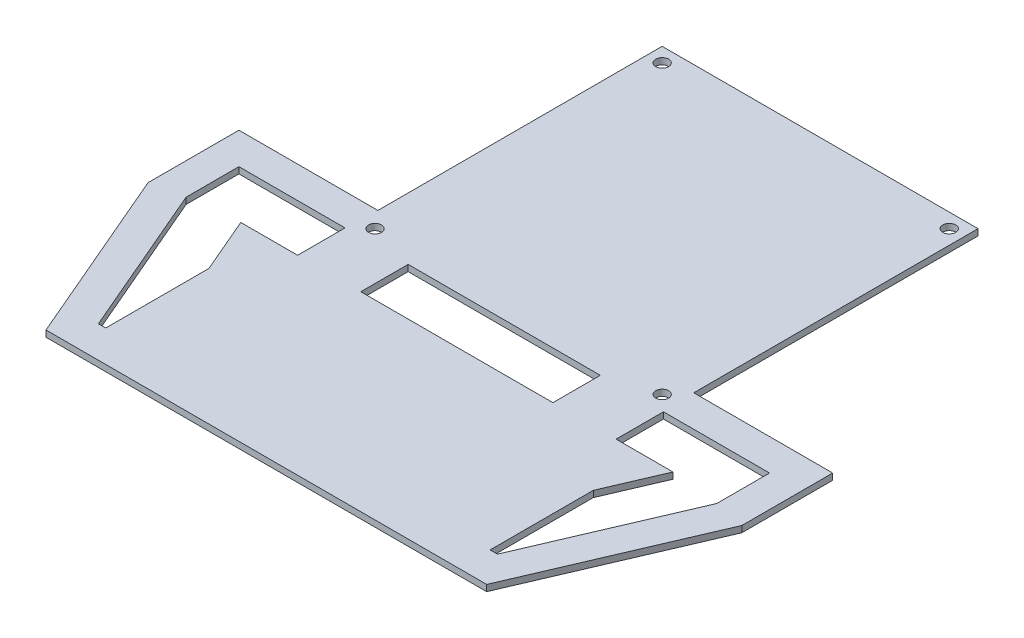
ISO-10303-21;
HEADER;
FILE_DESCRIPTION(('STEP AP214'),'2;1');
FILE_NAME('part.step','',(''),(''),'','','');
FILE_SCHEMA(('AUTOMOTIVE_DESIGN { 1 0 10303 214 1 1 1 1 }'));
ENDSEC;
DATA;
#1=APPLICATION_CONTEXT('core data for automotive mechanical design processes');
#2=APPLICATION_PROTOCOL_DEFINITION('international standard','automotive_design',2000,#1);
#3=PRODUCT_CONTEXT('',#1,'mechanical');
#4=PRODUCT('Part','Part','',(#3));
#5=PRODUCT_RELATED_PRODUCT_CATEGORY('part','',(#4));
#6=PRODUCT_DEFINITION_FORMATION('','',#4);
#7=PRODUCT_DEFINITION_CONTEXT('part definition',#1,'design');
#8=PRODUCT_DEFINITION('design','',#6,#7);
#9=PRODUCT_DEFINITION_SHAPE('','',#8);
#10=(LENGTH_UNIT() NAMED_UNIT(*) SI_UNIT(.MILLI.,.METRE.));
#11=(NAMED_UNIT(*) PLANE_ANGLE_UNIT() SI_UNIT($,.RADIAN.));
#12=(NAMED_UNIT(*) SI_UNIT($,.STERADIAN.) SOLID_ANGLE_UNIT());
#13=UNCERTAINTY_MEASURE_WITH_UNIT(LENGTH_MEASURE(1.E-05),#10,'distance_accuracy_value','');
#14=(GEOMETRIC_REPRESENTATION_CONTEXT(3) GLOBAL_UNCERTAINTY_ASSIGNED_CONTEXT((#13)) GLOBAL_UNIT_ASSIGNED_CONTEXT((#10,
#11,#12)) REPRESENTATION_CONTEXT('',''));
#15=CARTESIAN_POINT('',(0.,0.,0.));
#16=DIRECTION('',(0.,0.,1.));
#17=DIRECTION('',(1.,0.,0.));
#18=AXIS2_PLACEMENT_3D('',#15,#16,#17);
#19=CARTESIAN_POINT('',(0.,2.,40.0000000000001));
#20=DIRECTION('',(0.,0.,-1.));
#21=DIRECTION('',(-1.,0.,0.));
#22=AXIS2_PLACEMENT_3D('',#19,#20,#21);
#23=PLANE('',#22);
#24=DIRECTION('',(1.,0.,0.));
#25=VECTOR('',#24,1.);
#26=CARTESIAN_POINT('',(0.,0.,40.0000000000001));
#27=LINE('',#26,#25);
#28=CARTESIAN_POINT('',(50.,0.,40.0000000000001));
#29=VERTEX_POINT('',#28);
#30=CARTESIAN_POINT('',(94.,0.,40.0000000000001));
#31=VERTEX_POINT('',#30);
#32=EDGE_CURVE('E328',#29,#31,#27,.T.);
#33=ORIENTED_EDGE('',*,*,#32,.F.);
#34=DIRECTION('',(0.,-1.,0.));
#35=VECTOR('',#34,1.);
#36=CARTESIAN_POINT('',(50.,2.,40.0000000000001));
#37=LINE('',#36,#35);
#38=CARTESIAN_POINT('',(50.,2.,40.0000000000001));
#39=VERTEX_POINT('',#38);
#40=EDGE_CURVE('E403',#39,#29,#37,.T.);
#41=ORIENTED_EDGE('',*,*,#40,.F.);
#42=DIRECTION('',(1.,0.,0.));
#43=VECTOR('',#42,1.);
#44=CARTESIAN_POINT('',(0.,2.,40.0000000000001));
#45=LINE('',#44,#43);
#46=CARTESIAN_POINT('',(94.,2.,40.0000000000001));
#47=VERTEX_POINT('',#46);
#48=EDGE_CURVE('E331',#39,#47,#45,.T.);
#49=ORIENTED_EDGE('',*,*,#48,.T.);
#50=DIRECTION('',(0.,-1.,0.));
#51=VECTOR('',#50,1.);
#52=CARTESIAN_POINT('',(94.,2.,40.0000000000001));
#53=LINE('',#52,#51);
#54=EDGE_CURVE('E357',#47,#31,#53,.T.);
#55=ORIENTED_EDGE('',*,*,#54,.T.);
#56=EDGE_LOOP('',(#33,#41,#49,#55));
#57=FACE_BOUND('',#56,.T.);
#58=ADVANCED_FACE('F34',(#57),#23,.T.);
#59=CARTESIAN_POINT('',(50.,2.,0.));
#60=DIRECTION('',(-1.,0.,0.));
#61=DIRECTION('',(0.,0.,1.));
#62=AXIS2_PLACEMENT_3D('',#59,#60,#61);
#63=PLANE('',#62);
#64=DIRECTION('',(0.,0.,-1.));
#65=VECTOR('',#64,1.);
#66=CARTESIAN_POINT('',(50.,0.,0.));
#67=LINE('',#66,#65);
#68=CARTESIAN_POINT('',(50.,0.,-50.));
#69=VERTEX_POINT('',#68);
#70=EDGE_CURVE('E360',#29,#69,#67,.T.);
#71=ORIENTED_EDGE('',*,*,#70,.T.);
#72=DIRECTION('',(0.,-1.,0.));
#73=VECTOR('',#72,1.);
#74=CARTESIAN_POINT('',(50.,2.,-50.));
#75=LINE('',#74,#73);
#76=CARTESIAN_POINT('',(50.,2.,-50.));
#77=VERTEX_POINT('',#76);
#78=EDGE_CURVE('E400',#77,#69,#75,.T.);
#79=ORIENTED_EDGE('',*,*,#78,.F.);
#80=DIRECTION('',(0.,0.,-1.));
#81=VECTOR('',#80,1.);
#82=CARTESIAN_POINT('',(50.,2.,0.));
#83=LINE('',#82,#81);
#84=EDGE_CURVE('E334',#39,#77,#83,.T.);
#85=ORIENTED_EDGE('',*,*,#84,.F.);
#86=ORIENTED_EDGE('',*,*,#40,.T.);
#87=EDGE_LOOP('',(#71,#79,#85,#86));
#88=FACE_BOUND('',#87,.T.);
#89=ADVANCED_FACE('F529',(#88),#63,.F.);
#90=CARTESIAN_POINT('',(0.,2.,-50.));
#91=DIRECTION('',(0.,0.,1.));
#92=DIRECTION('',(1.,0.,0.));
#93=AXIS2_PLACEMENT_3D('',#90,#91,#92);
#94=PLANE('',#93);
#95=DIRECTION('',(-1.,0.,0.));
#96=VECTOR('',#95,1.);
#97=CARTESIAN_POINT('',(0.,0.,-50.));
#98=LINE('',#97,#96);
#99=CARTESIAN_POINT('',(-50.,0.,-50.));
#100=VERTEX_POINT('',#99);
#101=EDGE_CURVE('E362',#69,#100,#98,.T.);
#102=ORIENTED_EDGE('',*,*,#101,.T.);
#103=DIRECTION('',(0.,-1.,0.));
#104=VECTOR('',#103,1.);
#105=CARTESIAN_POINT('',(-50.,2.,-50.));
#106=LINE('',#105,#104);
#107=CARTESIAN_POINT('',(-50.,2.,-50.));
#108=VERTEX_POINT('',#107);
#109=EDGE_CURVE('E398',#108,#100,#106,.T.);
#110=ORIENTED_EDGE('',*,*,#109,.F.);
#111=DIRECTION('',(-1.,0.,0.));
#112=VECTOR('',#111,1.);
#113=CARTESIAN_POINT('',(0.,2.,-50.));
#114=LINE('',#113,#112);
#115=EDGE_CURVE('E337',#77,#108,#114,.T.);
#116=ORIENTED_EDGE('',*,*,#115,.F.);
#117=ORIENTED_EDGE('',*,*,#78,.T.);
#118=EDGE_LOOP('',(#102,#110,#116,#117));
#119=FACE_BOUND('',#118,.T.);
#120=ADVANCED_FACE('F534',(#119),#94,.F.);
#121=CARTESIAN_POINT('',(-50.,2.,0.));
#122=DIRECTION('',(-1.,0.,0.));
#123=DIRECTION('',(0.,0.,1.));
#124=AXIS2_PLACEMENT_3D('',#121,#122,#123);
#125=PLANE('',#124);
#126=DIRECTION('',(0.,0.,-1.));
#127=VECTOR('',#126,1.);
#128=CARTESIAN_POINT('',(-50.,0.,0.));
#129=LINE('',#128,#127);
#130=CARTESIAN_POINT('',(-50.,0.,40.0000000000001));
#131=VERTEX_POINT('',#130);
#132=EDGE_CURVE('E365',#131,#100,#129,.T.);
#133=ORIENTED_EDGE('',*,*,#132,.F.);
#134=DIRECTION('',(0.,-1.,0.));
#135=VECTOR('',#134,1.);
#136=CARTESIAN_POINT('',(-50.,2.,40.0000000000001));
#137=LINE('',#136,#135);
#138=CARTESIAN_POINT('',(-50.,2.,40.0000000000001));
#139=VERTEX_POINT('',#138);
#140=EDGE_CURVE('E396',#139,#131,#137,.T.);
#141=ORIENTED_EDGE('',*,*,#140,.F.);
#142=DIRECTION('',(0.,0.,-1.));
#143=VECTOR('',#142,1.);
#144=CARTESIAN_POINT('',(-50.,2.,0.));
#145=LINE('',#144,#143);
#146=EDGE_CURVE('E339',#139,#108,#145,.T.);
#147=ORIENTED_EDGE('',*,*,#146,.T.);
#148=ORIENTED_EDGE('',*,*,#109,.T.);
#149=EDGE_LOOP('',(#133,#141,#147,#148));
#150=FACE_BOUND('',#149,.T.);
#151=ADVANCED_FACE('F571',(#150),#125,.T.);
#152=CARTESIAN_POINT('',(0.,2.,40.0000000000001));
#153=DIRECTION('',(0.,0.,1.));
#154=DIRECTION('',(1.,0.,0.));
#155=AXIS2_PLACEMENT_3D('',#152,#153,#154);
#156=PLANE('',#155);
#157=DIRECTION('',(-1.,0.,0.));
#158=VECTOR('',#157,1.);
#159=CARTESIAN_POINT('',(0.,0.,40.0000000000001));
#160=LINE('',#159,#158);
#161=CARTESIAN_POINT('',(-94.,0.,40.0000000000001));
#162=VERTEX_POINT('',#161);
#163=EDGE_CURVE('E368',#131,#162,#160,.T.);
#164=ORIENTED_EDGE('',*,*,#163,.T.);
#165=DIRECTION('',(0.,-1.,0.));
#166=VECTOR('',#165,1.);
#167=CARTESIAN_POINT('',(-94.,2.,40.0000000000001));
#168=LINE('',#167,#166);
#169=CARTESIAN_POINT('',(-94.,2.,40.0000000000001));
#170=VERTEX_POINT('',#169);
#171=EDGE_CURVE('E393',#170,#162,#168,.T.);
#172=ORIENTED_EDGE('',*,*,#171,.F.);
#173=DIRECTION('',(-1.,0.,0.));
#174=VECTOR('',#173,1.);
#175=CARTESIAN_POINT('',(0.,2.,40.0000000000001));
#176=LINE('',#175,#174);
#177=EDGE_CURVE('E342',#139,#170,#176,.T.);
#178=ORIENTED_EDGE('',*,*,#177,.F.);
#179=ORIENTED_EDGE('',*,*,#140,.T.);
#180=EDGE_LOOP('',(#164,#172,#178,#179));
#181=FACE_BOUND('',#180,.T.);
#182=ADVANCED_FACE('F568',(#181),#156,.F.);
#183=CARTESIAN_POINT('',(-94.,2.,1.36035679588699E-13));
#184=DIRECTION('',(1.,0.,0.));
#185=DIRECTION('',(0.,0.,-1.));
#186=AXIS2_PLACEMENT_3D('',#183,#184,#185);
#187=PLANE('',#186);
#188=DIRECTION('',(0.,0.,1.));
#189=VECTOR('',#188,1.);
#190=CARTESIAN_POINT('',(-94.,0.,1.36035679588699E-13));
#191=LINE('',#190,#189);
#192=CARTESIAN_POINT('',(-93.9999999999999,0.,68.7684537882722));
#193=VERTEX_POINT('',#192);
#194=EDGE_CURVE('E370',#162,#193,#191,.T.);
#195=ORIENTED_EDGE('',*,*,#194,.T.);
#196=DIRECTION('',(0.,-1.,0.));
#197=VECTOR('',#196,1.);
#198=CARTESIAN_POINT('',(-93.9999999999999,2.,68.7684537882722));
#199=LINE('',#198,#197);
#200=CARTESIAN_POINT('',(-93.9999999999999,2.,68.7684537882722));
#201=VERTEX_POINT('',#200);
#202=EDGE_CURVE('E391',#201,#193,#199,.T.);
#203=ORIENTED_EDGE('',*,*,#202,.F.);
#204=DIRECTION('',(0.,0.,1.));
#205=VECTOR('',#204,1.);
#206=CARTESIAN_POINT('',(-94.,2.,1.36035679588699E-13));
#207=LINE('',#206,#205);
#208=EDGE_CURVE('E344',#170,#201,#207,.T.);
#209=ORIENTED_EDGE('',*,*,#208,.F.);
#210=ORIENTED_EDGE('',*,*,#171,.T.);
#211=EDGE_LOOP('',(#195,#203,#209,#210));
#212=FACE_BOUND('',#211,.T.);
#213=ADVANCED_FACE('F563',(#212),#187,.F.);
#214=CARTESIAN_POINT('',(-104.311598443848,2.,44.711653626802));
#215=DIRECTION('',(-0.919123708270864,0.,0.393969045604368));
#216=DIRECTION('',(0.393969045604367,0.,0.919123708270864));
#217=AXIS2_PLACEMENT_3D('',#214,#215,#216);
#218=PLANE('',#217);
#219=DIRECTION('',(-0.393969045604368,0.,-0.919123708270864));
#220=VECTOR('',#219,1.);
#221=CARTESIAN_POINT('',(-104.311598443848,0.,44.711653626802));
#222=LINE('',#221,#220);
#223=CARTESIAN_POINT('',(-69.76,0.,125.32));
#224=VERTEX_POINT('',#223);
#225=EDGE_CURVE('E373',#224,#193,#222,.T.);
#226=ORIENTED_EDGE('',*,*,#225,.F.);
#227=DIRECTION('',(0.,-1.,0.));
#228=VECTOR('',#227,1.);
#229=CARTESIAN_POINT('',(-69.76,2.,125.32));
#230=LINE('',#229,#228);
#231=CARTESIAN_POINT('',(-69.76,2.,125.32));
#232=VERTEX_POINT('',#231);
#233=EDGE_CURVE('E389',#232,#224,#230,.T.);
#234=ORIENTED_EDGE('',*,*,#233,.F.);
#235=DIRECTION('',(-0.393969045604368,0.,-0.919123708270864));
#236=VECTOR('',#235,1.);
#237=CARTESIAN_POINT('',(-104.311598443848,2.,44.711653626802));
#238=LINE('',#237,#236);
#239=EDGE_CURVE('E346',#232,#201,#238,.T.);
#240=ORIENTED_EDGE('',*,*,#239,.T.);
#241=ORIENTED_EDGE('',*,*,#202,.T.);
#242=EDGE_LOOP('',(#226,#234,#240,#241));
#243=FACE_BOUND('',#242,.T.);
#244=ADVANCED_FACE('F557',(#243),#218,.T.);
#245=CARTESIAN_POINT('',(0.,2.,125.32));
#246=DIRECTION('',(0.,0.,1.));
#247=DIRECTION('',(1.,0.,0.));
#248=AXIS2_PLACEMENT_3D('',#245,#246,#247);
#249=PLANE('',#248);
#250=DIRECTION('',(-1.,0.,0.));
#251=VECTOR('',#250,1.);
#252=CARTESIAN_POINT('',(0.,0.,125.32));
#253=LINE('',#252,#251);
#254=CARTESIAN_POINT('',(69.76,0.,125.32));
#255=VERTEX_POINT('',#254);
#256=EDGE_CURVE('E376',#255,#224,#253,.T.);
#257=ORIENTED_EDGE('',*,*,#256,.F.);
#258=DIRECTION('',(0.,-1.,0.));
#259=VECTOR('',#258,1.);
#260=CARTESIAN_POINT('',(69.76,2.,125.32));
#261=LINE('',#260,#259);
#262=CARTESIAN_POINT('',(69.76,2.,125.32));
#263=VERTEX_POINT('',#262);
#264=EDGE_CURVE('E387',#263,#255,#261,.T.);
#265=ORIENTED_EDGE('',*,*,#264,.F.);
#266=DIRECTION('',(-1.,0.,0.));
#267=VECTOR('',#266,1.);
#268=CARTESIAN_POINT('',(0.,2.,125.32));
#269=LINE('',#268,#267);
#270=EDGE_CURVE('E349',#263,#232,#269,.T.);
#271=ORIENTED_EDGE('',*,*,#270,.T.);
#272=ORIENTED_EDGE('',*,*,#233,.T.);
#273=EDGE_LOOP('',(#257,#265,#271,#272));
#274=FACE_BOUND('',#273,.T.);
#275=ADVANCED_FACE('F552',(#274),#249,.T.);
#276=CARTESIAN_POINT('',(104.311598443848,2.,44.7116536268021));
#277=DIRECTION('',(-0.919123708270864,0.,-0.393969045604368));
#278=DIRECTION('',(-0.393969045604368,0.,0.919123708270864));
#279=AXIS2_PLACEMENT_3D('',#276,#277,#278);
#280=PLANE('',#279);
#281=DIRECTION('',(0.393969045604368,0.,-0.919123708270864));
#282=VECTOR('',#281,1.);
#283=CARTESIAN_POINT('',(104.311598443848,0.,44.7116536268021));
#284=LINE('',#283,#282);
#285=CARTESIAN_POINT('',(94.,0.,68.7684537882722));
#286=VERTEX_POINT('',#285);
#287=EDGE_CURVE('E379',#255,#286,#284,.T.);
#288=ORIENTED_EDGE('',*,*,#287,.T.);
#289=DIRECTION('',(0.,-1.,0.));
#290=VECTOR('',#289,1.);
#291=CARTESIAN_POINT('',(94.,2.,68.7684537882722));
#292=LINE('',#291,#290);
#293=CARTESIAN_POINT('',(94.,2.,68.7684537882722));
#294=VERTEX_POINT('',#293);
#295=EDGE_CURVE('E385',#294,#286,#292,.T.);
#296=ORIENTED_EDGE('',*,*,#295,.F.);
#297=DIRECTION('',(0.393969045604368,0.,-0.919123708270864));
#298=VECTOR('',#297,1.);
#299=CARTESIAN_POINT('',(104.311598443848,2.,44.7116536268021));
#300=LINE('',#299,#298);
#301=EDGE_CURVE('E352',#263,#294,#300,.T.);
#302=ORIENTED_EDGE('',*,*,#301,.F.);
#303=ORIENTED_EDGE('',*,*,#264,.T.);
#304=EDGE_LOOP('',(#288,#296,#302,#303));
#305=FACE_BOUND('',#304,.T.);
#306=ADVANCED_FACE('F549',(#305),#280,.F.);
#307=CARTESIAN_POINT('',(94.,2.,0.));
#308=DIRECTION('',(1.,0.,0.));
#309=DIRECTION('',(0.,0.,-1.));
#310=AXIS2_PLACEMENT_3D('',#307,#308,#309);
#311=PLANE('',#310);
#312=DIRECTION('',(0.,0.,1.));
#313=VECTOR('',#312,1.);
#314=CARTESIAN_POINT('',(94.,0.,0.));
#315=LINE('',#314,#313);
#316=EDGE_CURVE('E335',#31,#286,#315,.T.);
#317=ORIENTED_EDGE('',*,*,#316,.F.);
#318=ORIENTED_EDGE('',*,*,#54,.F.);
#319=DIRECTION('',(0.,0.,1.));
#320=VECTOR('',#319,1.);
#321=CARTESIAN_POINT('',(94.,2.,0.));
#322=LINE('',#321,#320);
#323=EDGE_CURVE('E354',#47,#294,#322,.T.);
#324=ORIENTED_EDGE('',*,*,#323,.T.);
#325=ORIENTED_EDGE('',*,*,#295,.T.);
#326=EDGE_LOOP('',(#317,#318,#324,#325));
#327=FACE_BOUND('',#326,.T.);
#328=ADVANCED_FACE('F544',(#327),#311,.T.);
#329=CARTESIAN_POINT('',(0.,2.,0.));
#330=DIRECTION('',(0.,1.,0.));
#331=DIRECTION('',(0.,0.,1.));
#332=AXIS2_PLACEMENT_3D('',#329,#330,#331);
#333=PLANE('',#332);
#334=DIRECTION('',(0.,0.,-1.));
#335=VECTOR('',#334,1.);
#336=CARTESIAN_POINT('',(-50.4154724265905,2.,0.));
#337=LINE('',#336,#335);
#338=CARTESIAN_POINT('',(-50.4154724265904,2.,65.0000000000001));
#339=VERTEX_POINT('',#338);
#340=CARTESIAN_POINT('',(-50.4154724265904,2.,50.0000000000001));
#341=VERTEX_POINT('',#340);
#342=EDGE_CURVE('E304',#339,#341,#337,.T.);
#343=ORIENTED_EDGE('',*,*,#342,.F.);
#344=DIRECTION('',(-1.,0.,0.));
#345=VECTOR('',#344,1.);
#346=CARTESIAN_POINT('',(0.,2.,65.0000000000001));
#347=LINE('',#346,#345);
#348=CARTESIAN_POINT('',(-68.4154724265905,2.,65.0000000000001));
#349=VERTEX_POINT('',#348);
#350=EDGE_CURVE('E299',#339,#349,#347,.T.);
#351=ORIENTED_EDGE('',*,*,#350,.T.);
#352=DIRECTION('',(-0.393969045604372,0.,-0.919123708270862));
#353=VECTOR('',#352,1.);
#354=CARTESIAN_POINT('',(-81.3335057370761,2.,34.8624274866933));
#355=LINE('',#354,#353);
#356=CARTESIAN_POINT('',(-60.8457695859769,2.000006,82.6600000000001));
#357=VERTEX_POINT('',#356);
#358=EDGE_CURVE('E295',#357,#349,#355,.T.);
#359=ORIENTED_EDGE('',*,*,#358,.F.);
#360=DIRECTION('',(0.,0.,1.));
#361=VECTOR('',#360,1.);
#362=CARTESIAN_POINT('',(-60.845769585977,2.,0.));
#363=LINE('',#362,#361);
#364=CARTESIAN_POINT('',(-60.8457695859769,2.,115.32));
#365=VERTEX_POINT('',#364);
#366=EDGE_CURVE('E292',#357,#365,#363,.T.);
#367=ORIENTED_EDGE('',*,*,#366,.T.);
#368=DIRECTION('',(-1.,0.,0.));
#369=VECTOR('',#368,1.);
#370=CARTESIAN_POINT('',(-2.75850573806091E-12,2.,115.320000000002));
#371=LINE('',#370,#369);
#372=CARTESIAN_POINT('',(-63.1664266981455,2.,115.32));
#373=VERTEX_POINT('',#372);
#374=EDGE_CURVE('E290',#365,#373,#371,.T.);
#375=ORIENTED_EDGE('',*,*,#374,.T.);
#376=DIRECTION('',(-0.393969045604368,0.,-0.919123708270864));
#377=VECTOR('',#376,1.);
#378=CARTESIAN_POINT('',(-95.120361361139,2.,40.7719631707584));
#379=LINE('',#378,#377);
#380=CARTESIAN_POINT('',(-84.,2.000006,66.7155947468958));
#381=VERTEX_POINT('',#380);
#382=EDGE_CURVE('E851',#373,#381,#379,.T.);
#383=ORIENTED_EDGE('',*,*,#382,.T.);
#384=DIRECTION('',(0.,0.,1.));
#385=VECTOR('',#384,1.);
#386=CARTESIAN_POINT('',(-84.,2.,0.));
#387=LINE('',#386,#385);
#388=CARTESIAN_POINT('',(-84.,2.,50.0000000000001));
#389=VERTEX_POINT('',#388);
#390=EDGE_CURVE('E267',#389,#381,#387,.T.);
#391=ORIENTED_EDGE('',*,*,#390,.F.);
#392=DIRECTION('',(-1.,0.,0.));
#393=VECTOR('',#392,1.);
#394=CARTESIAN_POINT('',(0.,2.,50.0000000000001));
#395=LINE('',#394,#393);
#396=EDGE_CURVE('E241',#341,#389,#395,.T.);
#397=ORIENTED_EDGE('',*,*,#396,.F.);
#398=EDGE_LOOP('',(#343,#351,#359,#367,#375,#383,#391,#397));
#399=FACE_BOUND('',#398,.T.);
#400=DIRECTION('',(-0.393969045604368,0.,0.919123708270864));
#401=VECTOR('',#400,1.);
#402=CARTESIAN_POINT('',(81.3335057370761,2.,34.8624274866929));
#403=LINE('',#402,#401);
#404=CARTESIAN_POINT('',(68.4154724265905,2.,65.0000000000001));
#405=VERTEX_POINT('',#404);
#406=CARTESIAN_POINT('',(60.8457695859771,2.,82.6600000000001));
#407=VERTEX_POINT('',#406);
#408=EDGE_CURVE('E231',#405,#407,#403,.T.);
#409=ORIENTED_EDGE('',*,*,#408,.F.);
#410=DIRECTION('',(-1.,0.,0.));
#411=VECTOR('',#410,1.);
#412=CARTESIAN_POINT('',(0.,2.,65.0000000000001));
#413=LINE('',#412,#411);
#414=CARTESIAN_POINT('',(50.4154724265905,2.,65.0000000000001));
#415=VERTEX_POINT('',#414);
#416=EDGE_CURVE('E879',#405,#415,#413,.T.);
#417=ORIENTED_EDGE('',*,*,#416,.T.);
#418=DIRECTION('',(0.,0.,1.));
#419=VECTOR('',#418,1.);
#420=CARTESIAN_POINT('',(50.4154724265905,2.,0.));
#421=LINE('',#420,#419);
#422=CARTESIAN_POINT('',(50.4154724265905,2.,50.0000000000001));
#423=VERTEX_POINT('',#422);
#424=EDGE_CURVE('E880',#423,#415,#421,.T.);
#425=ORIENTED_EDGE('',*,*,#424,.F.);
#426=DIRECTION('',(-1.,0.,0.));
#427=VECTOR('',#426,1.);
#428=CARTESIAN_POINT('',(0.,2.,50.0000000000001));
#429=LINE('',#428,#427);
#430=CARTESIAN_POINT('',(84.,2.,50.0000000000001));
#431=VERTEX_POINT('',#430);
#432=EDGE_CURVE('E497',#431,#423,#429,.T.);
#433=ORIENTED_EDGE('',*,*,#432,.F.);
#434=DIRECTION('',(0.,0.,-1.));
#435=VECTOR('',#434,1.);
#436=CARTESIAN_POINT('',(84.,2.,0.));
#437=LINE('',#436,#435);
#438=CARTESIAN_POINT('',(84.,2.,66.7155947468957));
#439=VERTEX_POINT('',#438);
#440=EDGE_CURVE('E499',#439,#431,#437,.T.);
#441=ORIENTED_EDGE('',*,*,#440,.F.);
#442=DIRECTION('',(-0.393969045604368,0.,0.919123708270864));
#443=VECTOR('',#442,1.);
#444=CARTESIAN_POINT('',(95.120361361139,2.,40.7719631707584));
#445=LINE('',#444,#443);
#446=CARTESIAN_POINT('',(63.1664266981454,2.,115.32));
#447=VERTEX_POINT('',#446);
#448=EDGE_CURVE('E258',#439,#447,#445,.T.);
#449=ORIENTED_EDGE('',*,*,#448,.T.);
#450=DIRECTION('',(1.,0.,0.));
#451=VECTOR('',#450,1.);
#452=CARTESIAN_POINT('',(0.,2.,115.32));
#453=LINE('',#452,#451);
#454=CARTESIAN_POINT('',(60.8457695859771,2.,115.32));
#455=VERTEX_POINT('',#454);
#456=EDGE_CURVE('E256',#455,#447,#453,.T.);
#457=ORIENTED_EDGE('',*,*,#456,.F.);
#458=DIRECTION('',(0.,0.,-1.));
#459=VECTOR('',#458,1.);
#460=CARTESIAN_POINT('',(60.8457695859771,2.,0.));
#461=LINE('',#460,#459);
#462=EDGE_CURVE('E242',#455,#407,#461,.T.);
#463=ORIENTED_EDGE('',*,*,#462,.T.);
#464=EDGE_LOOP('',(#409,#417,#425,#433,#441,#449,#457,#463));
#465=FACE_BOUND('',#464,.T.);
#466=DIRECTION('',(0.,0.,1.));
#467=VECTOR('',#466,1.);
#468=CARTESIAN_POINT('',(-30.4154724265905,2.,0.));
#469=LINE('',#468,#467);
#470=CARTESIAN_POINT('',(-30.4154724265904,2.,50.0000000000001));
#471=VERTEX_POINT('',#470);
#472=CARTESIAN_POINT('',(-30.4154724265904,2.,65.0000000000001));
#473=VERTEX_POINT('',#472);
#474=EDGE_CURVE('E877',#471,#473,#469,.T.);
#475=ORIENTED_EDGE('',*,*,#474,.F.);
#476=DIRECTION('',(1.,0.,0.));
#477=VECTOR('',#476,1.);
#478=CARTESIAN_POINT('',(0.,2.,50.0000000000001));
#479=LINE('',#478,#477);
#480=CARTESIAN_POINT('',(30.4154724265905,2.,50.0000000000001));
#481=VERTEX_POINT('',#480);
#482=EDGE_CURVE('E869',#471,#481,#479,.T.);
#483=ORIENTED_EDGE('',*,*,#482,.T.);
#484=DIRECTION('',(0.,0.,1.));
#485=VECTOR('',#484,1.);
#486=CARTESIAN_POINT('',(30.4154724265905,2.,0.));
#487=LINE('',#486,#485);
#488=CARTESIAN_POINT('',(30.4154724265905,2.,65.0000000000001));
#489=VERTEX_POINT('',#488);
#490=EDGE_CURVE('E872',#481,#489,#487,.T.);
#491=ORIENTED_EDGE('',*,*,#490,.T.);
#492=DIRECTION('',(1.,0.,0.));
#493=VECTOR('',#492,1.);
#494=CARTESIAN_POINT('',(0.,2.,65.0000000000001));
#495=LINE('',#494,#493);
#496=EDGE_CURVE('E875',#473,#489,#495,.T.);
#497=ORIENTED_EDGE('',*,*,#496,.F.);
#498=EDGE_LOOP('',(#475,#483,#491,#497));
#499=FACE_BOUND('',#498,.T.);
#500=CARTESIAN_POINT('',(45.45,2.,45.45));
#501=DIRECTION('',(0.,1.,0.));
#502=DIRECTION('',(1.,0.,0.));
#503=AXIS2_PLACEMENT_3D('',#500,#501,#502);
#504=CIRCLE('',#503,2.04999999999999);
#505=CARTESIAN_POINT('',(47.5,2.,45.45));
#506=VERTEX_POINT('',#505);
#507=EDGE_CURVE('E317',#506,#506,#504,.T.);
#508=ORIENTED_EDGE('',*,*,#507,.F.);
#509=EDGE_LOOP('',(#508));
#510=FACE_BOUND('',#509,.T.);
#511=CARTESIAN_POINT('',(-45.45,2.,-45.45));
#512=DIRECTION('',(0.,1.,0.));
#513=DIRECTION('',(1.,0.,0.));
#514=AXIS2_PLACEMENT_3D('',#511,#512,#513);
#515=CIRCLE('',#514,2.04999999999999);
#516=CARTESIAN_POINT('',(-43.4,2.,-45.45));
#517=VERTEX_POINT('',#516);
#518=EDGE_CURVE('E310',#517,#517,#515,.T.);
#519=ORIENTED_EDGE('',*,*,#518,.F.);
#520=EDGE_LOOP('',(#519));
#521=FACE_BOUND('',#520,.T.);
#522=CARTESIAN_POINT('',(45.45,2.,-45.45));
#523=DIRECTION('',(0.,1.,0.));
#524=DIRECTION('',(-1.,0.,0.));
#525=AXIS2_PLACEMENT_3D('',#522,#523,#524);
#526=CIRCLE('',#525,2.04999999999999);
#527=CARTESIAN_POINT('',(43.4,2.,-45.45));
#528=VERTEX_POINT('',#527);
#529=EDGE_CURVE('E306',#528,#528,#526,.T.);
#530=ORIENTED_EDGE('',*,*,#529,.F.);
#531=EDGE_LOOP('',(#530));
#532=FACE_BOUND('',#531,.T.);
#533=CARTESIAN_POINT('',(-45.45,2.,45.45));
#534=DIRECTION('',(0.,1.,0.));
#535=DIRECTION('',(-1.,0.,0.));
#536=AXIS2_PLACEMENT_3D('',#533,#534,#535);
#537=CIRCLE('',#536,2.04999999999999);
#538=CARTESIAN_POINT('',(-47.5,2.,45.45));
#539=VERTEX_POINT('',#538);
#540=EDGE_CURVE('E316',#539,#539,#537,.T.);
#541=ORIENTED_EDGE('',*,*,#540,.F.);
#542=EDGE_LOOP('',(#541));
#543=FACE_BOUND('',#542,.T.);
#544=ORIENTED_EDGE('',*,*,#48,.F.);
#545=ORIENTED_EDGE('',*,*,#84,.T.);
#546=ORIENTED_EDGE('',*,*,#115,.T.);
#547=ORIENTED_EDGE('',*,*,#146,.F.);
#548=ORIENTED_EDGE('',*,*,#177,.T.);
#549=ORIENTED_EDGE('',*,*,#208,.T.);
#550=ORIENTED_EDGE('',*,*,#239,.F.);
#551=ORIENTED_EDGE('',*,*,#270,.F.);
#552=ORIENTED_EDGE('',*,*,#301,.T.);
#553=ORIENTED_EDGE('',*,*,#323,.F.);
#554=EDGE_LOOP('',(#544,#545,#546,#547,#548,#549,#550,#551,#552,#553));
#555=FACE_BOUND('',#554,.T.);
#556=ADVANCED_FACE('F253',(#399,#465,#499,#510,#521,#532,#543,#555),#333,.T.);
#557=CARTESIAN_POINT('',(0.,0.,0.));
#558=DIRECTION('',(0.,1.,0.));
#559=DIRECTION('',(0.,0.,1.));
#560=AXIS2_PLACEMENT_3D('',#557,#558,#559);
#561=PLANE('',#560);
#562=DIRECTION('',(-1.,0.,0.));
#563=VECTOR('',#562,1.);
#564=CARTESIAN_POINT('',(0.,0.,65.0000000000001));
#565=LINE('',#564,#563);
#566=CARTESIAN_POINT('',(-50.4154724265904,0.,65.0000000000001));
#567=VERTEX_POINT('',#566);
#568=CARTESIAN_POINT('',(-68.4154724265905,0.,65.0000000000001));
#569=VERTEX_POINT('',#568);
#570=EDGE_CURVE('E41',#567,#569,#565,.T.);
#571=ORIENTED_EDGE('',*,*,#570,.F.);
#572=DIRECTION('',(0.,0.,-1.));
#573=VECTOR('',#572,1.);
#574=CARTESIAN_POINT('',(-50.4154724265905,0.,0.));
#575=LINE('',#574,#573);
#576=CARTESIAN_POINT('',(-50.4154724265904,0.,50.0000000000001));
#577=VERTEX_POINT('',#576);
#578=EDGE_CURVE('E11',#567,#577,#575,.T.);
#579=ORIENTED_EDGE('',*,*,#578,.T.);
#580=DIRECTION('',(-1.,0.,0.));
#581=VECTOR('',#580,1.);
#582=CARTESIAN_POINT('',(0.,0.,50.0000000000001));
#583=LINE('',#582,#581);
#584=CARTESIAN_POINT('',(-84.,0.,50.0000000000001));
#585=VERTEX_POINT('',#584);
#586=EDGE_CURVE('E434',#577,#585,#583,.T.);
#587=ORIENTED_EDGE('',*,*,#586,.T.);
#588=DIRECTION('',(0.,0.,1.));
#589=VECTOR('',#588,1.);
#590=CARTESIAN_POINT('',(-84.,0.,0.));
#591=LINE('',#590,#589);
#592=CARTESIAN_POINT('',(-84.,0.,66.7155947468958));
#593=VERTEX_POINT('',#592);
#594=EDGE_CURVE('E437',#585,#593,#591,.T.);
#595=ORIENTED_EDGE('',*,*,#594,.T.);
#596=DIRECTION('',(-0.393969045604368,0.,-0.919123708270864));
#597=VECTOR('',#596,1.);
#598=CARTESIAN_POINT('',(-95.120361361139,0.,40.7719631707584));
#599=LINE('',#598,#597);
#600=CARTESIAN_POINT('',(-63.1664266981455,0.,115.32));
#601=VERTEX_POINT('',#600);
#602=EDGE_CURVE('E440',#601,#593,#599,.T.);
#603=ORIENTED_EDGE('',*,*,#602,.F.);
#604=DIRECTION('',(-1.,0.,0.));
#605=VECTOR('',#604,1.);
#606=CARTESIAN_POINT('',(-2.75850573806091E-12,0.,115.320000000002));
#607=LINE('',#606,#605);
#608=CARTESIAN_POINT('',(-60.8457695859769,0.,115.32));
#609=VERTEX_POINT('',#608);
#610=EDGE_CURVE('E442',#609,#601,#607,.T.);
#611=ORIENTED_EDGE('',*,*,#610,.F.);
#612=DIRECTION('',(0.,0.,1.));
#613=VECTOR('',#612,1.);
#614=CARTESIAN_POINT('',(-60.845769585977,0.,0.));
#615=LINE('',#614,#613);
#616=CARTESIAN_POINT('',(-60.8457695859769,0.,82.6600000000001));
#617=VERTEX_POINT('',#616);
#618=EDGE_CURVE('E444',#617,#609,#615,.T.);
#619=ORIENTED_EDGE('',*,*,#618,.F.);
#620=DIRECTION('',(-0.393969045604372,0.,-0.919123708270862));
#621=VECTOR('',#620,1.);
#622=CARTESIAN_POINT('',(-81.3335057370761,0.,34.8624274866933));
#623=LINE('',#622,#621);
#624=EDGE_CURVE('E446',#617,#569,#623,.T.);
#625=ORIENTED_EDGE('',*,*,#624,.T.);
#626=EDGE_LOOP('',(#571,#579,#587,#595,#603,#611,#619,#625));
#627=FACE_BOUND('',#626,.T.);
#628=DIRECTION('',(-1.,0.,0.));
#629=VECTOR('',#628,1.);
#630=CARTESIAN_POINT('',(0.,0.,65.0000000000001));
#631=LINE('',#630,#629);
#632=CARTESIAN_POINT('',(68.4154724265905,0.,65.0000000000001));
#633=VERTEX_POINT('',#632);
#634=CARTESIAN_POINT('',(50.4154724265905,0.,65.0000000000001));
#635=VERTEX_POINT('',#634);
#636=EDGE_CURVE('E415',#633,#635,#631,.T.);
#637=ORIENTED_EDGE('',*,*,#636,.F.);
#638=DIRECTION('',(-0.393969045604368,0.,0.919123708270864));
#639=VECTOR('',#638,1.);
#640=CARTESIAN_POINT('',(81.3335057370761,0.,34.8624274866929));
#641=LINE('',#640,#639);
#642=CARTESIAN_POINT('',(60.8457695859771,0.,82.6600000000001));
#643=VERTEX_POINT('',#642);
#644=EDGE_CURVE('E432',#633,#643,#641,.T.);
#645=ORIENTED_EDGE('',*,*,#644,.T.);
#646=DIRECTION('',(0.,0.,-1.));
#647=VECTOR('',#646,1.);
#648=CARTESIAN_POINT('',(60.8457695859771,0.,0.));
#649=LINE('',#648,#647);
#650=CARTESIAN_POINT('',(60.8457695859771,0.,115.32));
#651=VERTEX_POINT('',#650);
#652=EDGE_CURVE('E249',#651,#643,#649,.T.);
#653=ORIENTED_EDGE('',*,*,#652,.F.);
#654=DIRECTION('',(1.,0.,0.));
#655=VECTOR('',#654,1.);
#656=CARTESIAN_POINT('',(0.,0.,115.32));
#657=LINE('',#656,#655);
#658=CARTESIAN_POINT('',(63.1664266981454,0.,115.32));
#659=VERTEX_POINT('',#658);
#660=EDGE_CURVE('E428',#651,#659,#657,.T.);
#661=ORIENTED_EDGE('',*,*,#660,.T.);
#662=DIRECTION('',(-0.393969045604368,0.,0.919123708270864));
#663=VECTOR('',#662,1.);
#664=CARTESIAN_POINT('',(95.120361361139,0.,40.7719631707584));
#665=LINE('',#664,#663);
#666=CARTESIAN_POINT('',(84.,0.,66.7155947468957));
#667=VERTEX_POINT('',#666);
#668=EDGE_CURVE('E426',#667,#659,#665,.T.);
#669=ORIENTED_EDGE('',*,*,#668,.F.);
#670=DIRECTION('',(0.,0.,-1.));
#671=VECTOR('',#670,1.);
#672=CARTESIAN_POINT('',(84.,0.,0.));
#673=LINE('',#672,#671);
#674=CARTESIAN_POINT('',(84.,0.,50.0000000000001));
#675=VERTEX_POINT('',#674);
#676=EDGE_CURVE('E423',#667,#675,#673,.T.);
#677=ORIENTED_EDGE('',*,*,#676,.T.);
#678=DIRECTION('',(-1.,0.,0.));
#679=VECTOR('',#678,1.);
#680=CARTESIAN_POINT('',(0.,0.,50.0000000000001));
#681=LINE('',#680,#679);
#682=CARTESIAN_POINT('',(50.4154724265905,0.,50.0000000000001));
#683=VERTEX_POINT('',#682);
#684=EDGE_CURVE('E420',#675,#683,#681,.T.);
#685=ORIENTED_EDGE('',*,*,#684,.T.);
#686=DIRECTION('',(0.,0.,1.));
#687=VECTOR('',#686,1.);
#688=CARTESIAN_POINT('',(50.4154724265905,0.,0.));
#689=LINE('',#688,#687);
#690=EDGE_CURVE('E417',#683,#635,#689,.T.);
#691=ORIENTED_EDGE('',*,*,#690,.T.);
#692=EDGE_LOOP('',(#637,#645,#653,#661,#669,#677,#685,#691));
#693=FACE_BOUND('',#692,.T.);
#694=DIRECTION('',(1.,0.,0.));
#695=VECTOR('',#694,1.);
#696=CARTESIAN_POINT('',(0.,0.,50.0000000000001));
#697=LINE('',#696,#695);
#698=CARTESIAN_POINT('',(-30.4154724265904,0.,50.0000000000001));
#699=VERTEX_POINT('',#698);
#700=CARTESIAN_POINT('',(30.4154724265905,0.,50.0000000000001));
#701=VERTEX_POINT('',#700);
#702=EDGE_CURVE('E405',#699,#701,#697,.T.);
#703=ORIENTED_EDGE('',*,*,#702,.F.);
#704=DIRECTION('',(0.,0.,1.));
#705=VECTOR('',#704,1.);
#706=CARTESIAN_POINT('',(-30.4154724265905,0.,0.));
#707=LINE('',#706,#705);
#708=CARTESIAN_POINT('',(-30.4154724265904,0.,65.0000000000001));
#709=VERTEX_POINT('',#708);
#710=EDGE_CURVE('E412',#699,#709,#707,.T.);
#711=ORIENTED_EDGE('',*,*,#710,.T.);
#712=DIRECTION('',(1.,0.,0.));
#713=VECTOR('',#712,1.);
#714=CARTESIAN_POINT('',(0.,0.,65.0000000000001));
#715=LINE('',#714,#713);
#716=CARTESIAN_POINT('',(30.4154724265905,0.,65.0000000000001));
#717=VERTEX_POINT('',#716);
#718=EDGE_CURVE('E409',#709,#717,#715,.T.);
#719=ORIENTED_EDGE('',*,*,#718,.T.);
#720=DIRECTION('',(0.,0.,1.));
#721=VECTOR('',#720,1.);
#722=CARTESIAN_POINT('',(30.4154724265905,0.,0.));
#723=LINE('',#722,#721);
#724=EDGE_CURVE('E407',#701,#717,#723,.T.);
#725=ORIENTED_EDGE('',*,*,#724,.F.);
#726=EDGE_LOOP('',(#703,#711,#719,#725));
#727=FACE_BOUND('',#726,.T.);
#728=CARTESIAN_POINT('',(45.45,0.,45.45));
#729=DIRECTION('',(0.,1.,0.));
#730=DIRECTION('',(1.,0.,0.));
#731=AXIS2_PLACEMENT_3D('',#728,#729,#730);
#732=CIRCLE('',#731,2.04999999999999);
#733=CARTESIAN_POINT('',(47.5,0.,45.45));
#734=VERTEX_POINT('',#733);
#735=EDGE_CURVE('E313',#734,#734,#732,.T.);
#736=ORIENTED_EDGE('',*,*,#735,.T.);
#737=EDGE_LOOP('',(#736));
#738=FACE_BOUND('',#737,.T.);
#739=CARTESIAN_POINT('',(-45.45,0.,-45.45));
#740=DIRECTION('',(0.,1.,0.));
#741=DIRECTION('',(1.,0.,0.));
#742=AXIS2_PLACEMENT_3D('',#739,#740,#741);
#743=CIRCLE('',#742,2.04999999999999);
#744=CARTESIAN_POINT('',(-43.4,0.,-45.45));
#745=VERTEX_POINT('',#744);
#746=EDGE_CURVE('E320',#745,#745,#743,.T.);
#747=ORIENTED_EDGE('',*,*,#746,.T.);
#748=EDGE_LOOP('',(#747));
#749=FACE_BOUND('',#748,.T.);
#750=CARTESIAN_POINT('',(45.45,0.,-45.45));
#751=DIRECTION('',(0.,1.,0.));
#752=DIRECTION('',(-1.,0.,0.));
#753=AXIS2_PLACEMENT_3D('',#750,#751,#752);
#754=CIRCLE('',#753,2.04999999999999);
#755=CARTESIAN_POINT('',(43.4,0.,-45.45));
#756=VERTEX_POINT('',#755);
#757=EDGE_CURVE('E307',#756,#756,#754,.T.);
#758=ORIENTED_EDGE('',*,*,#757,.T.);
#759=EDGE_LOOP('',(#758));
#760=FACE_BOUND('',#759,.T.);
#761=CARTESIAN_POINT('',(-45.45,0.,45.45));
#762=DIRECTION('',(0.,1.,0.));
#763=DIRECTION('',(-1.,0.,0.));
#764=AXIS2_PLACEMENT_3D('',#761,#762,#763);
#765=CIRCLE('',#764,2.04999999999999);
#766=CARTESIAN_POINT('',(-47.5,0.,45.45));
#767=VERTEX_POINT('',#766);
#768=EDGE_CURVE('E325',#767,#767,#765,.T.);
#769=ORIENTED_EDGE('',*,*,#768,.T.);
#770=EDGE_LOOP('',(#769));
#771=FACE_BOUND('',#770,.T.);
#772=ORIENTED_EDGE('',*,*,#32,.T.);
#773=ORIENTED_EDGE('',*,*,#316,.T.);
#774=ORIENTED_EDGE('',*,*,#287,.F.);
#775=ORIENTED_EDGE('',*,*,#256,.T.);
#776=ORIENTED_EDGE('',*,*,#225,.T.);
#777=ORIENTED_EDGE('',*,*,#194,.F.);
#778=ORIENTED_EDGE('',*,*,#163,.F.);
#779=ORIENTED_EDGE('',*,*,#132,.T.);
#780=ORIENTED_EDGE('',*,*,#101,.F.);
#781=ORIENTED_EDGE('',*,*,#70,.F.);
#782=EDGE_LOOP('',(#772,#773,#774,#775,#776,#777,#778,#779,#780,#781));
#783=FACE_BOUND('',#782,.T.);
#784=ADVANCED_FACE('F463',(#627,#693,#727,#738,#749,#760,#771,#783),#561,.F.);
#785=CARTESIAN_POINT('',(-45.45,0.,45.45));
#786=DIRECTION('',(0.,1.,0.));
#787=DIRECTION('',(-1.,0.,0.));
#788=AXIS2_PLACEMENT_3D('',#785,#786,#787);
#789=CYLINDRICAL_SURFACE('',#788,2.04999999999999);
#790=ORIENTED_EDGE('',*,*,#768,.F.);
#791=EDGE_LOOP('',(#790));
#792=FACE_BOUND('',#791,.T.);
#793=ORIENTED_EDGE('',*,*,#540,.T.);
#794=EDGE_LOOP('',(#793));
#795=FACE_BOUND('',#794,.T.);
#796=ADVANCED_FACE('F585',(#792,#795),#789,.F.);
#797=CARTESIAN_POINT('',(45.45,0.,-45.45));
#798=DIRECTION('',(0.,1.,0.));
#799=DIRECTION('',(-1.,0.,0.));
#800=AXIS2_PLACEMENT_3D('',#797,#798,#799);
#801=CYLINDRICAL_SURFACE('',#800,2.04999999999999);
#802=ORIENTED_EDGE('',*,*,#757,.F.);
#803=EDGE_LOOP('',(#802));
#804=FACE_BOUND('',#803,.T.);
#805=ORIENTED_EDGE('',*,*,#529,.T.);
#806=EDGE_LOOP('',(#805));
#807=FACE_BOUND('',#806,.T.);
#808=ADVANCED_FACE('F656',(#804,#807),#801,.F.);
#809=CARTESIAN_POINT('',(-45.45,0.,-45.45));
#810=DIRECTION('',(0.,1.,0.));
#811=DIRECTION('',(-1.,0.,0.));
#812=AXIS2_PLACEMENT_3D('',#809,#810,#811);
#813=CYLINDRICAL_SURFACE('',#812,2.04999999999999);
#814=ORIENTED_EDGE('',*,*,#746,.F.);
#815=EDGE_LOOP('',(#814));
#816=FACE_BOUND('',#815,.T.);
#817=ORIENTED_EDGE('',*,*,#518,.T.);
#818=EDGE_LOOP('',(#817));
#819=FACE_BOUND('',#818,.T.);
#820=ADVANCED_FACE('F662',(#816,#819),#813,.F.);
#821=CARTESIAN_POINT('',(45.45,0.,45.45));
#822=DIRECTION('',(0.,1.,0.));
#823=DIRECTION('',(-1.,0.,0.));
#824=AXIS2_PLACEMENT_3D('',#821,#822,#823);
#825=CYLINDRICAL_SURFACE('',#824,2.04999999999999);
#826=ORIENTED_EDGE('',*,*,#735,.F.);
#827=EDGE_LOOP('',(#826));
#828=FACE_BOUND('',#827,.T.);
#829=ORIENTED_EDGE('',*,*,#507,.T.);
#830=EDGE_LOOP('',(#829));
#831=FACE_BOUND('',#830,.T.);
#832=ADVANCED_FACE('F670',(#828,#831),#825,.F.);
#833=CARTESIAN_POINT('',(-30.4154724265905,2.000012,0.));
#834=DIRECTION('',(-1.,0.,0.));
#835=DIRECTION('',(0.,0.,1.));
#836=AXIS2_PLACEMENT_3D('',#833,#834,#835);
#837=PLANE('',#836);
#838=ORIENTED_EDGE('',*,*,#474,.T.);
#839=DIRECTION('',(0.,-1.,0.));
#840=VECTOR('',#839,1.);
#841=CARTESIAN_POINT('',(-30.4154724265904,2.000012,65.0000000000001));
#842=LINE('',#841,#840);
#843=EDGE_CURVE('E864',#473,#709,#842,.T.);
#844=ORIENTED_EDGE('',*,*,#843,.T.);
#845=ORIENTED_EDGE('',*,*,#710,.F.);
#846=DIRECTION('',(0.,-1.,0.));
#847=VECTOR('',#846,1.);
#848=CARTESIAN_POINT('',(-30.4154724265904,2.000012,50.0000000000001));
#849=LINE('',#848,#847);
#850=EDGE_CURVE('E281',#471,#699,#849,.T.);
#851=ORIENTED_EDGE('',*,*,#850,.F.);
#852=EDGE_LOOP('',(#838,#844,#845,#851));
#853=FACE_BOUND('',#852,.T.);
#854=ADVANCED_FACE('F676',(#853),#837,.F.);
#855=CARTESIAN_POINT('',(0.,2.000012,65.0000000000001));
#856=DIRECTION('',(0.,0.,1.));
#857=DIRECTION('',(1.,0.,0.));
#858=AXIS2_PLACEMENT_3D('',#855,#856,#857);
#859=PLANE('',#858);
#860=ORIENTED_EDGE('',*,*,#496,.T.);
#861=DIRECTION('',(0.,-1.,0.));
#862=VECTOR('',#861,1.);
#863=CARTESIAN_POINT('',(30.4154724265905,2.000012,65.0000000000001));
#864=LINE('',#863,#862);
#865=EDGE_CURVE('E860',#489,#717,#864,.T.);
#866=ORIENTED_EDGE('',*,*,#865,.T.);
#867=ORIENTED_EDGE('',*,*,#718,.F.);
#868=ORIENTED_EDGE('',*,*,#843,.F.);
#869=EDGE_LOOP('',(#860,#866,#867,#868));
#870=FACE_BOUND('',#869,.T.);
#871=ADVANCED_FACE('F683',(#870),#859,.F.);
#872=CARTESIAN_POINT('',(30.4154724265905,2.000012,0.));
#873=DIRECTION('',(-1.,0.,0.));
#874=DIRECTION('',(0.,0.,1.));
#875=AXIS2_PLACEMENT_3D('',#872,#873,#874);
#876=PLANE('',#875);
#877=DIRECTION('',(0.,-1.,0.));
#878=VECTOR('',#877,1.);
#879=CARTESIAN_POINT('',(30.4154724265905,2.000012,50.0000000000001));
#880=LINE('',#879,#878);
#881=EDGE_CURVE('E856',#481,#701,#880,.T.);
#882=ORIENTED_EDGE('',*,*,#881,.T.);
#883=ORIENTED_EDGE('',*,*,#724,.T.);
#884=ORIENTED_EDGE('',*,*,#865,.F.);
#885=ORIENTED_EDGE('',*,*,#490,.F.);
#886=EDGE_LOOP('',(#882,#883,#884,#885));
#887=FACE_BOUND('',#886,.T.);
#888=ADVANCED_FACE('F691',(#887),#876,.T.);
#889=CARTESIAN_POINT('',(0.,2.000012,50.0000000000001));
#890=DIRECTION('',(0.,0.,1.));
#891=DIRECTION('',(1.,0.,0.));
#892=AXIS2_PLACEMENT_3D('',#889,#890,#891);
#893=PLANE('',#892);
#894=ORIENTED_EDGE('',*,*,#850,.T.);
#895=ORIENTED_EDGE('',*,*,#702,.T.);
#896=ORIENTED_EDGE('',*,*,#881,.F.);
#897=ORIENTED_EDGE('',*,*,#482,.F.);
#898=EDGE_LOOP('',(#894,#895,#896,#897));
#899=FACE_BOUND('',#898,.T.);
#900=ADVANCED_FACE('F699',(#899),#893,.T.);
#901=CARTESIAN_POINT('',(81.3335057370761,2.000012,34.8624274866929));
#902=DIRECTION('',(-0.919123708270864,0.,-0.393969045604368));
#903=DIRECTION('',(-0.393969045604368,0.,0.919123708270864));
#904=AXIS2_PLACEMENT_3D('',#901,#902,#903);
#905=PLANE('',#904);
#906=ORIENTED_EDGE('',*,*,#408,.T.);
#907=DIRECTION('',(0.,1.,0.));
#908=VECTOR('',#907,1.);
#909=CARTESIAN_POINT('',(60.8457695859771,-3.,82.6600000000001));
#910=LINE('',#909,#908);
#911=EDGE_CURVE('E235',#643,#407,#910,.T.);
#912=ORIENTED_EDGE('',*,*,#911,.F.);
#913=ORIENTED_EDGE('',*,*,#644,.F.);
#914=DIRECTION('',(0.,-1.,0.));
#915=VECTOR('',#914,1.);
#916=CARTESIAN_POINT('',(68.4154724265905,2.000012,65.0000000000001));
#917=LINE('',#916,#915);
#918=EDGE_CURVE('E237',#405,#633,#917,.T.);
#919=ORIENTED_EDGE('',*,*,#918,.F.);
#920=EDGE_LOOP('',(#906,#912,#913,#919));
#921=FACE_BOUND('',#920,.T.);
#922=ADVANCED_FACE('F233',(#921),#905,.F.);
#923=CARTESIAN_POINT('',(60.8457695859771,2.000012,0.));
#924=DIRECTION('',(1.,0.,0.));
#925=DIRECTION('',(0.,0.,-1.));
#926=AXIS2_PLACEMENT_3D('',#923,#924,#925);
#927=PLANE('',#926);
#928=DIRECTION('',(0.,-1.,0.));
#929=VECTOR('',#928,1.);
#930=CARTESIAN_POINT('',(60.8457695859771,2.000012,115.32));
#931=LINE('',#930,#929);
#932=EDGE_CURVE('E483',#455,#651,#931,.T.);
#933=ORIENTED_EDGE('',*,*,#932,.T.);
#934=ORIENTED_EDGE('',*,*,#652,.T.);
#935=ORIENTED_EDGE('',*,*,#911,.T.);
#936=ORIENTED_EDGE('',*,*,#462,.F.);
#937=EDGE_LOOP('',(#933,#934,#935,#936));
#938=FACE_BOUND('',#937,.T.);
#939=ADVANCED_FACE('F246',(#938),#927,.T.);
#940=CARTESIAN_POINT('',(0.,2.000012,115.32));
#941=DIRECTION('',(0.,0.,1.));
#942=DIRECTION('',(1.,0.,0.));
#943=AXIS2_PLACEMENT_3D('',#940,#941,#942);
#944=PLANE('',#943);
#945=ORIENTED_EDGE('',*,*,#456,.T.);
#946=DIRECTION('',(0.,-1.,0.));
#947=VECTOR('',#946,1.);
#948=CARTESIAN_POINT('',(63.1664266981454,2.000012,115.32));
#949=LINE('',#948,#947);
#950=EDGE_CURVE('E484',#447,#659,#949,.T.);
#951=ORIENTED_EDGE('',*,*,#950,.T.);
#952=ORIENTED_EDGE('',*,*,#660,.F.);
#953=ORIENTED_EDGE('',*,*,#932,.F.);
#954=EDGE_LOOP('',(#945,#951,#952,#953));
#955=FACE_BOUND('',#954,.T.);
#956=ADVANCED_FACE('F519',(#955),#944,.F.);
#957=CARTESIAN_POINT('',(95.120361361139,2.000012,40.7719631707584));
#958=DIRECTION('',(-0.919123708270863,0.,-0.393969045604368));
#959=DIRECTION('',(-0.393969045604368,0.,0.919123708270864));
#960=AXIS2_PLACEMENT_3D('',#957,#958,#959);
#961=PLANE('',#960);
#962=DIRECTION('',(0.,1.,0.));
#963=VECTOR('',#962,1.);
#964=CARTESIAN_POINT('',(84.,-3.,66.7155947468957));
#965=LINE('',#964,#963);
#966=EDGE_CURVE('E250',#667,#439,#965,.T.);
#967=ORIENTED_EDGE('',*,*,#966,.F.);
#968=ORIENTED_EDGE('',*,*,#668,.T.);
#969=ORIENTED_EDGE('',*,*,#950,.F.);
#970=ORIENTED_EDGE('',*,*,#448,.F.);
#971=EDGE_LOOP('',(#967,#968,#969,#970));
#972=FACE_BOUND('',#971,.T.);
#973=ADVANCED_FACE('F510',(#972),#961,.T.);
#974=CARTESIAN_POINT('',(84.,2.000012,0.));
#975=DIRECTION('',(1.,0.,0.));
#976=DIRECTION('',(0.,0.,-1.));
#977=AXIS2_PLACEMENT_3D('',#974,#975,#976);
#978=PLANE('',#977);
#979=ORIENTED_EDGE('',*,*,#440,.T.);
#980=DIRECTION('',(0.,-1.,0.));
#981=VECTOR('',#980,1.);
#982=CARTESIAN_POINT('',(84.,2.000012,50.0000000000001));
#983=LINE('',#982,#981);
#984=EDGE_CURVE('E487',#431,#675,#983,.T.);
#985=ORIENTED_EDGE('',*,*,#984,.T.);
#986=ORIENTED_EDGE('',*,*,#676,.F.);
#987=ORIENTED_EDGE('',*,*,#966,.T.);
#988=EDGE_LOOP('',(#979,#985,#986,#987));
#989=FACE_BOUND('',#988,.T.);
#990=ADVANCED_FACE('F513',(#989),#978,.F.);
#991=CARTESIAN_POINT('',(0.,2.000012,50.0000000000001));
#992=DIRECTION('',(0.,0.,-1.));
#993=DIRECTION('',(-1.,0.,0.));
#994=AXIS2_PLACEMENT_3D('',#991,#992,#993);
#995=PLANE('',#994);
#996=ORIENTED_EDGE('',*,*,#432,.T.);
#997=DIRECTION('',(0.,-1.,0.));
#998=VECTOR('',#997,1.);
#999=CARTESIAN_POINT('',(50.4154724265905,2.000012,50.0000000000001));
#1000=LINE('',#999,#998);
#1001=EDGE_CURVE('E884',#423,#683,#1000,.T.);
#1002=ORIENTED_EDGE('',*,*,#1001,.T.);
#1003=ORIENTED_EDGE('',*,*,#684,.F.);
#1004=ORIENTED_EDGE('',*,*,#984,.F.);
#1005=EDGE_LOOP('',(#996,#1002,#1003,#1004));
#1006=FACE_BOUND('',#1005,.T.);
#1007=ADVANCED_FACE('F737',(#1006),#995,.F.);
#1008=CARTESIAN_POINT('',(50.4154724265905,2.000012,0.));
#1009=DIRECTION('',(-1.,0.,0.));
#1010=DIRECTION('',(0.,0.,1.));
#1011=AXIS2_PLACEMENT_3D('',#1008,#1009,#1010);
#1012=PLANE('',#1011);
#1013=ORIENTED_EDGE('',*,*,#424,.T.);
#1014=DIRECTION('',(0.,-1.,0.));
#1015=VECTOR('',#1014,1.);
#1016=CARTESIAN_POINT('',(50.4154724265905,2.000012,65.0000000000001));
#1017=LINE('',#1016,#1015);
#1018=EDGE_CURVE('E56',#415,#635,#1017,.T.);
#1019=ORIENTED_EDGE('',*,*,#1018,.T.);
#1020=ORIENTED_EDGE('',*,*,#690,.F.);
#1021=ORIENTED_EDGE('',*,*,#1001,.F.);
#1022=EDGE_LOOP('',(#1013,#1019,#1020,#1021));
#1023=FACE_BOUND('',#1022,.T.);
#1024=ADVANCED_FACE('F746',(#1023),#1012,.F.);
#1025=CARTESIAN_POINT('',(0.,2.000012,65.0000000000001));
#1026=DIRECTION('',(0.,0.,-1.));
#1027=DIRECTION('',(-1.,0.,0.));
#1028=AXIS2_PLACEMENT_3D('',#1025,#1026,#1027);
#1029=PLANE('',#1028);
#1030=ORIENTED_EDGE('',*,*,#918,.T.);
#1031=ORIENTED_EDGE('',*,*,#636,.T.);
#1032=ORIENTED_EDGE('',*,*,#1018,.F.);
#1033=ORIENTED_EDGE('',*,*,#416,.F.);
#1034=EDGE_LOOP('',(#1030,#1031,#1032,#1033));
#1035=FACE_BOUND('',#1034,.T.);
#1036=ADVANCED_FACE('F756',(#1035),#1029,.T.);
#1037=CARTESIAN_POINT('',(-50.4154724265905,-3.,0.));
#1038=DIRECTION('',(1.,0.,0.));
#1039=DIRECTION('',(0.,0.,-1.));
#1040=AXIS2_PLACEMENT_3D('',#1037,#1038,#1039);
#1041=PLANE('',#1040);
#1042=ORIENTED_EDGE('',*,*,#342,.T.);
#1043=DIRECTION('',(0.,1.,0.));
#1044=VECTOR('',#1043,1.);
#1045=CARTESIAN_POINT('',(-50.4154724265904,-3.,50.0000000000001));
#1046=LINE('',#1045,#1044);
#1047=EDGE_CURVE('E48',#577,#341,#1046,.T.);
#1048=ORIENTED_EDGE('',*,*,#1047,.F.);
#1049=ORIENTED_EDGE('',*,*,#578,.F.);
#1050=DIRECTION('',(0.,1.,0.));
#1051=VECTOR('',#1050,1.);
#1052=CARTESIAN_POINT('',(-50.4154724265904,-3.,65.0000000000001));
#1053=LINE('',#1052,#1051);
#1054=EDGE_CURVE('E455',#567,#339,#1053,.T.);
#1055=ORIENTED_EDGE('',*,*,#1054,.T.);
#1056=EDGE_LOOP('',(#1042,#1048,#1049,#1055));
#1057=FACE_BOUND('',#1056,.T.);
#1058=ADVANCED_FACE('F766',(#1057),#1041,.F.);
#1059=CARTESIAN_POINT('',(0.,-3.,65.0000000000001));
#1060=DIRECTION('',(0.,0.,-1.));
#1061=DIRECTION('',(-1.,0.,0.));
#1062=AXIS2_PLACEMENT_3D('',#1059,#1060,#1061);
#1063=PLANE('',#1062);
#1064=ORIENTED_EDGE('',*,*,#1054,.F.);
#1065=ORIENTED_EDGE('',*,*,#570,.T.);
#1066=DIRECTION('',(0.,1.,0.));
#1067=VECTOR('',#1066,1.);
#1068=CARTESIAN_POINT('',(-68.4154724265905,-3.,65.0000000000001));
#1069=LINE('',#1068,#1067);
#1070=EDGE_CURVE('E288',#569,#349,#1069,.T.);
#1071=ORIENTED_EDGE('',*,*,#1070,.T.);
#1072=ORIENTED_EDGE('',*,*,#350,.F.);
#1073=EDGE_LOOP('',(#1064,#1065,#1071,#1072));
#1074=FACE_BOUND('',#1073,.T.);
#1075=ADVANCED_FACE('F453',(#1074),#1063,.T.);
#1076=CARTESIAN_POINT('',(-81.3335057370761,-3.,34.8624274866933));
#1077=DIRECTION('',(0.919123708270862,0.,-0.393969045604372));
#1078=DIRECTION('',(-0.393969045604372,0.,-0.919123708270862));
#1079=AXIS2_PLACEMENT_3D('',#1076,#1077,#1078);
#1080=PLANE('',#1079);
#1081=ORIENTED_EDGE('',*,*,#358,.T.);
#1082=ORIENTED_EDGE('',*,*,#1070,.F.);
#1083=ORIENTED_EDGE('',*,*,#624,.F.);
#1084=DIRECTION('',(0.,1.,0.));
#1085=VECTOR('',#1084,1.);
#1086=CARTESIAN_POINT('',(-60.8457695859769,-3.,82.6600000000001));
#1087=LINE('',#1086,#1085);
#1088=EDGE_CURVE('E284',#617,#357,#1087,.T.);
#1089=ORIENTED_EDGE('',*,*,#1088,.T.);
#1090=EDGE_LOOP('',(#1081,#1082,#1083,#1089));
#1091=FACE_BOUND('',#1090,.T.);
#1092=ADVANCED_FACE('F458',(#1091),#1080,.F.);
#1093=CARTESIAN_POINT('',(-60.845769585977,-3.,0.));
#1094=DIRECTION('',(-1.,0.,0.));
#1095=DIRECTION('',(0.,0.,1.));
#1096=AXIS2_PLACEMENT_3D('',#1093,#1094,#1095);
#1097=PLANE('',#1096);
#1098=ORIENTED_EDGE('',*,*,#1088,.F.);
#1099=ORIENTED_EDGE('',*,*,#618,.T.);
#1100=DIRECTION('',(0.,1.,0.));
#1101=VECTOR('',#1100,1.);
#1102=CARTESIAN_POINT('',(-60.8457695859769,-3.,115.32));
#1103=LINE('',#1102,#1101);
#1104=EDGE_CURVE('E289',#609,#365,#1103,.T.);
#1105=ORIENTED_EDGE('',*,*,#1104,.T.);
#1106=ORIENTED_EDGE('',*,*,#366,.F.);
#1107=EDGE_LOOP('',(#1098,#1099,#1105,#1106));
#1108=FACE_BOUND('',#1107,.T.);
#1109=ADVANCED_FACE('F470',(#1108),#1097,.T.);
#1110=CARTESIAN_POINT('',(-2.75850573806091E-12,-3.,115.320000000002));
#1111=DIRECTION('',(0.,0.,-1.));
#1112=DIRECTION('',(-1.,0.,0.));
#1113=AXIS2_PLACEMENT_3D('',#1110,#1111,#1112);
#1114=PLANE('',#1113);
#1115=ORIENTED_EDGE('',*,*,#1104,.F.);
#1116=ORIENTED_EDGE('',*,*,#610,.T.);
#1117=DIRECTION('',(0.,1.,0.));
#1118=VECTOR('',#1117,1.);
#1119=CARTESIAN_POINT('',(-63.1664266981455,-3.,115.32));
#1120=LINE('',#1119,#1118);
#1121=EDGE_CURVE('E272',#601,#373,#1120,.T.);
#1122=ORIENTED_EDGE('',*,*,#1121,.T.);
#1123=ORIENTED_EDGE('',*,*,#374,.F.);
#1124=EDGE_LOOP('',(#1115,#1116,#1122,#1123));
#1125=FACE_BOUND('',#1124,.T.);
#1126=ADVANCED_FACE('F472',(#1125),#1114,.T.);
#1127=CARTESIAN_POINT('',(-95.1203613611391,-3.,40.7719631707584));
#1128=DIRECTION('',(0.919123708270864,0.,-0.393969045604368));
#1129=DIRECTION('',(-0.393969045604368,0.,-0.919123708270864));
#1130=AXIS2_PLACEMENT_3D('',#1127,#1128,#1129);
#1131=PLANE('',#1130);
#1132=ORIENTED_EDGE('',*,*,#1121,.F.);
#1133=ORIENTED_EDGE('',*,*,#602,.T.);
#1134=DIRECTION('',(0.,1.,0.));
#1135=VECTOR('',#1134,1.);
#1136=CARTESIAN_POINT('',(-84.,-3.,66.7155947468958));
#1137=LINE('',#1136,#1135);
#1138=EDGE_CURVE('E268',#593,#381,#1137,.T.);
#1139=ORIENTED_EDGE('',*,*,#1138,.T.);
#1140=ORIENTED_EDGE('',*,*,#382,.F.);
#1141=EDGE_LOOP('',(#1132,#1133,#1139,#1140));
#1142=FACE_BOUND('',#1141,.T.);
#1143=ADVANCED_FACE('F813',(#1142),#1131,.T.);
#1144=CARTESIAN_POINT('',(-84.,-3.,0.));
#1145=DIRECTION('',(-1.,0.,0.));
#1146=DIRECTION('',(0.,0.,1.));
#1147=AXIS2_PLACEMENT_3D('',#1144,#1145,#1146);
#1148=PLANE('',#1147);
#1149=ORIENTED_EDGE('',*,*,#390,.T.);
#1150=ORIENTED_EDGE('',*,*,#1138,.F.);
#1151=ORIENTED_EDGE('',*,*,#594,.F.);
#1152=DIRECTION('',(0.,1.,0.));
#1153=VECTOR('',#1152,1.);
#1154=CARTESIAN_POINT('',(-84.,-3.,50.0000000000001));
#1155=LINE('',#1154,#1153);
#1156=EDGE_CURVE('E273',#585,#389,#1155,.T.);
#1157=ORIENTED_EDGE('',*,*,#1156,.T.);
#1158=EDGE_LOOP('',(#1149,#1150,#1151,#1157));
#1159=FACE_BOUND('',#1158,.T.);
#1160=ADVANCED_FACE('F823',(#1159),#1148,.F.);
#1161=CARTESIAN_POINT('',(0.,-3.,50.0000000000001));
#1162=DIRECTION('',(0.,0.,-1.));
#1163=DIRECTION('',(-1.,0.,0.));
#1164=AXIS2_PLACEMENT_3D('',#1161,#1162,#1163);
#1165=PLANE('',#1164);
#1166=ORIENTED_EDGE('',*,*,#396,.T.);
#1167=ORIENTED_EDGE('',*,*,#1156,.F.);
#1168=ORIENTED_EDGE('',*,*,#586,.F.);
#1169=ORIENTED_EDGE('',*,*,#1047,.T.);
#1170=EDGE_LOOP('',(#1166,#1167,#1168,#1169));
#1171=FACE_BOUND('',#1170,.T.);
#1172=ADVANCED_FACE('F834',(#1171),#1165,.F.);
#1173=CLOSED_SHELL('',(#58,#89,#120,#151,#182,#213,#244,#275,#306,#328,#556,#784,#796,#808,#820,
#832,#854,#871,#888,#900,#922,#939,#956,#973,#990,#1007,#1024,#1036,#1058,#1075,#1092,#1109,
#1126,#1143,#1160,#1172));
#1174=MANIFOLD_SOLID_BREP('B2',#1173);
#1175=ADVANCED_BREP_SHAPE_REPRESENTATION('',(#18,#1174),#14);
#1176=SHAPE_DEFINITION_REPRESENTATION(#9,#1175);
ENDSEC;
END-ISO-10303-21;
